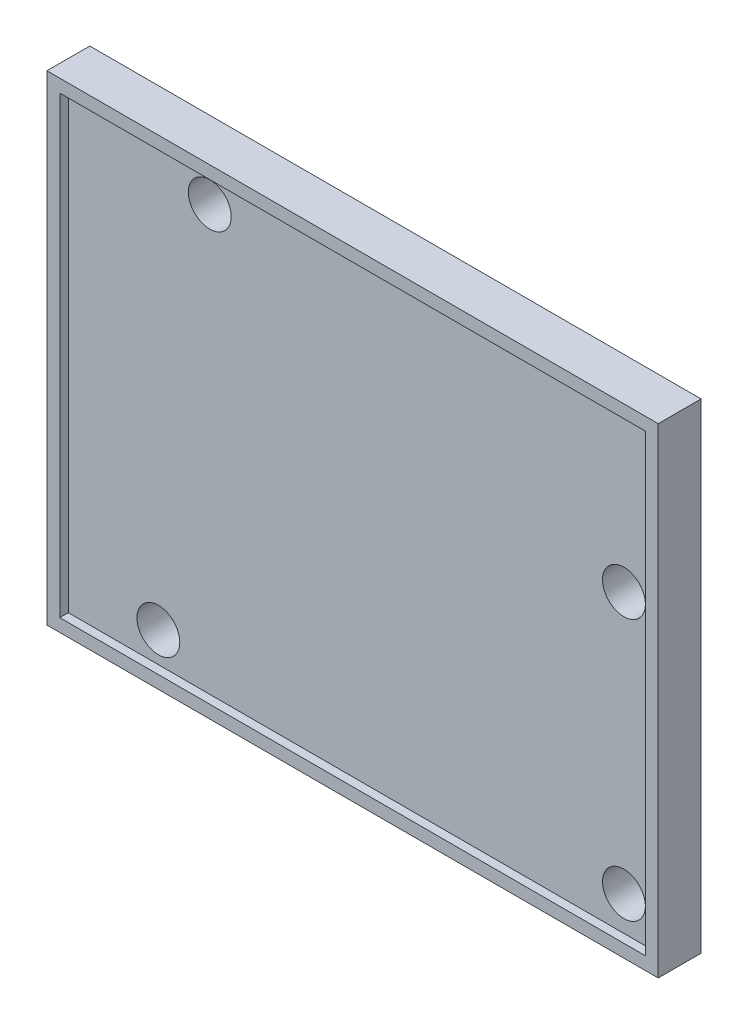
ISO-10303-21;
HEADER;
FILE_DESCRIPTION(('STEP AP214'),'2;1');
FILE_NAME('part.step','',(''),(''),'','','');
FILE_SCHEMA(('AUTOMOTIVE_DESIGN { 1 0 10303 214 1 1 1 1 }'));
ENDSEC;
DATA;
#1=APPLICATION_CONTEXT('core data for automotive mechanical design processes');
#2=APPLICATION_PROTOCOL_DEFINITION('international standard','automotive_design',2000,#1);
#3=PRODUCT_CONTEXT('',#1,'mechanical');
#4=PRODUCT('Part','Part','',(#3));
#5=PRODUCT_RELATED_PRODUCT_CATEGORY('part','',(#4));
#6=PRODUCT_DEFINITION_FORMATION('','',#4);
#7=PRODUCT_DEFINITION_CONTEXT('part definition',#1,'design');
#8=PRODUCT_DEFINITION('design','',#6,#7);
#9=PRODUCT_DEFINITION_SHAPE('','',#8);
#10=(LENGTH_UNIT() NAMED_UNIT(*) SI_UNIT(.MILLI.,.METRE.));
#11=(NAMED_UNIT(*) PLANE_ANGLE_UNIT() SI_UNIT($,.RADIAN.));
#12=(NAMED_UNIT(*) SI_UNIT($,.STERADIAN.) SOLID_ANGLE_UNIT());
#13=UNCERTAINTY_MEASURE_WITH_UNIT(LENGTH_MEASURE(1.E-05),#10,'distance_accuracy_value','');
#14=(GEOMETRIC_REPRESENTATION_CONTEXT(3) GLOBAL_UNCERTAINTY_ASSIGNED_CONTEXT((#13)) GLOBAL_UNIT_ASSIGNED_CONTEXT((#10,
#11,#12)) REPRESENTATION_CONTEXT('',''));
#15=CARTESIAN_POINT('',(0.,0.,0.));
#16=DIRECTION('',(0.,0.,1.));
#17=DIRECTION('',(1.,0.,0.));
#18=AXIS2_PLACEMENT_3D('',#15,#16,#17);
#19=CARTESIAN_POINT('',(30.655,-22.5,0.));
#20=DIRECTION('',(0.,0.,1.));
#21=DIRECTION('',(1.,0.,0.));
#22=AXIS2_PLACEMENT_3D('',#19,#20,#21);
#23=CYLINDRICAL_SURFACE('',#22,2.5);
#24=CARTESIAN_POINT('',(30.655,-22.5,0.));
#25=DIRECTION('',(0.,0.,1.));
#26=DIRECTION('',(1.,0.,0.));
#27=AXIS2_PLACEMENT_3D('',#24,#25,#26);
#28=CIRCLE('',#27,2.5);
#29=CARTESIAN_POINT('',(33.155,-22.5,0.));
#30=VERTEX_POINT('',#29);
#31=EDGE_CURVE('E163',#30,#30,#28,.T.);
#32=ORIENTED_EDGE('',*,*,#31,.F.);
#33=EDGE_LOOP('',(#32));
#34=FACE_BOUND('',#33,.T.);
#35=CARTESIAN_POINT('',(30.655,-22.5,4.));
#36=DIRECTION('',(0.,0.,1.));
#37=DIRECTION('',(1.,0.,0.));
#38=AXIS2_PLACEMENT_3D('',#35,#36,#37);
#39=CIRCLE('',#38,2.5);
#40=CARTESIAN_POINT('',(33.155,-22.5,4.));
#41=VERTEX_POINT('',#40);
#42=EDGE_CURVE('E160',#41,#41,#39,.F.);
#43=ORIENTED_EDGE('',*,*,#42,.F.);
#44=EDGE_LOOP('',(#43));
#45=FACE_BOUND('',#44,.T.);
#46=ADVANCED_FACE('F41',(#34,#45),#23,.F.);
#47=CARTESIAN_POINT('',(-17.655,23.,0.));
#48=DIRECTION('',(0.,0.,1.));
#49=DIRECTION('',(1.,0.,0.));
#50=AXIS2_PLACEMENT_3D('',#47,#48,#49);
#51=CYLINDRICAL_SURFACE('',#50,2.5);
#52=CARTESIAN_POINT('',(-17.655,23.,0.));
#53=DIRECTION('',(0.,0.,1.));
#54=DIRECTION('',(1.,0.,0.));
#55=AXIS2_PLACEMENT_3D('',#52,#53,#54);
#56=CIRCLE('',#55,2.5);
#57=CARTESIAN_POINT('',(-15.155,23.,0.));
#58=VERTEX_POINT('',#57);
#59=EDGE_CURVE('E171',#58,#58,#56,.T.);
#60=ORIENTED_EDGE('',*,*,#59,.F.);
#61=EDGE_LOOP('',(#60));
#62=FACE_BOUND('',#61,.T.);
#63=CARTESIAN_POINT('',(-17.655,23.,4.));
#64=DIRECTION('',(0.,0.,1.));
#65=DIRECTION('',(1.,0.,0.));
#66=AXIS2_PLACEMENT_3D('',#63,#64,#65);
#67=CIRCLE('',#66,2.5);
#68=CARTESIAN_POINT('',(-15.155,23.,4.));
#69=VERTEX_POINT('',#68);
#70=EDGE_CURVE('E157',#69,#69,#67,.F.);
#71=ORIENTED_EDGE('',*,*,#70,.F.);
#72=EDGE_LOOP('',(#71));
#73=FACE_BOUND('',#72,.T.);
#74=ADVANCED_FACE('F219',(#62,#73),#51,.F.);
#75=CARTESIAN_POINT('',(30.655,8.,0.));
#76=DIRECTION('',(0.,0.,1.));
#77=DIRECTION('',(1.,0.,0.));
#78=AXIS2_PLACEMENT_3D('',#75,#76,#77);
#79=CYLINDRICAL_SURFACE('',#78,2.5);
#80=CARTESIAN_POINT('',(30.655,8.,0.));
#81=DIRECTION('',(0.,0.,1.));
#82=DIRECTION('',(1.,0.,0.));
#83=AXIS2_PLACEMENT_3D('',#80,#81,#82);
#84=CIRCLE('',#83,2.5);
#85=CARTESIAN_POINT('',(33.155,8.,0.));
#86=VERTEX_POINT('',#85);
#87=EDGE_CURVE('E168',#86,#86,#84,.T.);
#88=ORIENTED_EDGE('',*,*,#87,.F.);
#89=EDGE_LOOP('',(#88));
#90=FACE_BOUND('',#89,.T.);
#91=CARTESIAN_POINT('',(30.655,8.,4.));
#92=DIRECTION('',(0.,0.,1.));
#93=DIRECTION('',(1.,0.,0.));
#94=AXIS2_PLACEMENT_3D('',#91,#92,#93);
#95=CIRCLE('',#94,2.5);
#96=CARTESIAN_POINT('',(33.155,8.,4.));
#97=VERTEX_POINT('',#96);
#98=EDGE_CURVE('E154',#97,#97,#95,.F.);
#99=ORIENTED_EDGE('',*,*,#98,.F.);
#100=EDGE_LOOP('',(#99));
#101=FACE_BOUND('',#100,.T.);
#102=ADVANCED_FACE('F215',(#90,#101),#79,.F.);
#103=CARTESIAN_POINT('',(-23.655,-23.,0.));
#104=DIRECTION('',(0.,0.,1.));
#105=DIRECTION('',(1.,0.,0.));
#106=AXIS2_PLACEMENT_3D('',#103,#104,#105);
#107=CYLINDRICAL_SURFACE('',#106,2.5);
#108=CARTESIAN_POINT('',(-23.655,-23.,0.));
#109=DIRECTION('',(0.,0.,1.));
#110=DIRECTION('',(1.,0.,0.));
#111=AXIS2_PLACEMENT_3D('',#108,#109,#110);
#112=CIRCLE('',#111,2.5);
#113=CARTESIAN_POINT('',(-21.155,-23.,0.));
#114=VERTEX_POINT('',#113);
#115=EDGE_CURVE('E164',#114,#114,#112,.T.);
#116=ORIENTED_EDGE('',*,*,#115,.F.);
#117=EDGE_LOOP('',(#116));
#118=FACE_BOUND('',#117,.T.);
#119=CARTESIAN_POINT('',(-23.655,-23.,4.));
#120=DIRECTION('',(0.,0.,1.));
#121=DIRECTION('',(1.,0.,0.));
#122=AXIS2_PLACEMENT_3D('',#119,#120,#121);
#123=CIRCLE('',#122,2.5);
#124=CARTESIAN_POINT('',(-21.155,-23.,4.));
#125=VERTEX_POINT('',#124);
#126=EDGE_CURVE('E45',#125,#125,#123,.F.);
#127=ORIENTED_EDGE('',*,*,#126,.F.);
#128=EDGE_LOOP('',(#127));
#129=FACE_BOUND('',#128,.T.);
#130=ADVANCED_FACE('F210',(#118,#129),#107,.F.);
#131=CARTESIAN_POINT('',(35.655,28.,5.));
#132=DIRECTION('',(0.,-1.,0.));
#133=DIRECTION('',(1.,0.,0.));
#134=AXIS2_PLACEMENT_3D('',#131,#132,#133);
#135=PLANE('',#134);
#136=DIRECTION('',(-1.,0.,0.));
#137=VECTOR('',#136,1.);
#138=CARTESIAN_POINT('',(35.655,28.,0.));
#139=LINE('',#138,#137);
#140=CARTESIAN_POINT('',(35.655,28.,0.));
#141=VERTEX_POINT('',#140);
#142=CARTESIAN_POINT('',(-35.655,28.,0.));
#143=VERTEX_POINT('',#142);
#144=EDGE_CURVE('E167',#141,#143,#139,.T.);
#145=ORIENTED_EDGE('',*,*,#144,.T.);
#146=DIRECTION('',(0.,0.,-1.));
#147=VECTOR('',#146,1.);
#148=CARTESIAN_POINT('',(-35.655,28.,5.));
#149=LINE('',#148,#147);
#150=CARTESIAN_POINT('',(-35.655,28.,5.));
#151=VERTEX_POINT('',#150);
#152=EDGE_CURVE('E11',#151,#143,#149,.T.);
#153=ORIENTED_EDGE('',*,*,#152,.F.);
#154=DIRECTION('',(-1.,0.,0.));
#155=VECTOR('',#154,1.);
#156=CARTESIAN_POINT('',(35.655,28.,5.));
#157=LINE('',#156,#155);
#158=CARTESIAN_POINT('',(35.655,28.,5.));
#159=VERTEX_POINT('',#158);
#160=EDGE_CURVE('E176',#159,#151,#157,.T.);
#161=ORIENTED_EDGE('',*,*,#160,.F.);
#162=DIRECTION('',(0.,0.,-1.));
#163=VECTOR('',#162,1.);
#164=CARTESIAN_POINT('',(35.655,28.,5.));
#165=LINE('',#164,#163);
#166=EDGE_CURVE('E66',#159,#141,#165,.T.);
#167=ORIENTED_EDGE('',*,*,#166,.T.);
#168=EDGE_LOOP('',(#145,#153,#161,#167));
#169=FACE_BOUND('',#168,.T.);
#170=ADVANCED_FACE('F43',(#169),#135,.F.);
#171=CARTESIAN_POINT('',(-35.655,28.,5.));
#172=DIRECTION('',(1.,0.,0.));
#173=DIRECTION('',(0.,1.,0.));
#174=AXIS2_PLACEMENT_3D('',#171,#172,#173);
#175=PLANE('',#174);
#176=DIRECTION('',(0.,-1.,0.));
#177=VECTOR('',#176,1.);
#178=CARTESIAN_POINT('',(-35.655,28.,0.));
#179=LINE('',#178,#177);
#180=CARTESIAN_POINT('',(-35.655,-28.,0.));
#181=VERTEX_POINT('',#180);
#182=EDGE_CURVE('E186',#143,#181,#179,.T.);
#183=ORIENTED_EDGE('',*,*,#182,.T.);
#184=DIRECTION('',(0.,0.,-1.));
#185=VECTOR('',#184,1.);
#186=CARTESIAN_POINT('',(-35.655,-28.,5.));
#187=LINE('',#186,#185);
#188=CARTESIAN_POINT('',(-35.655,-28.,5.));
#189=VERTEX_POINT('',#188);
#190=EDGE_CURVE('E50',#189,#181,#187,.T.);
#191=ORIENTED_EDGE('',*,*,#190,.F.);
#192=DIRECTION('',(0.,-1.,0.));
#193=VECTOR('',#192,1.);
#194=CARTESIAN_POINT('',(-35.655,28.,5.));
#195=LINE('',#194,#193);
#196=EDGE_CURVE('E92',#151,#189,#195,.T.);
#197=ORIENTED_EDGE('',*,*,#196,.F.);
#198=ORIENTED_EDGE('',*,*,#152,.T.);
#199=EDGE_LOOP('',(#183,#191,#197,#198));
#200=FACE_BOUND('',#199,.T.);
#201=ADVANCED_FACE('F201',(#200),#175,.F.);
#202=CARTESIAN_POINT('',(35.655,-28.,5.));
#203=DIRECTION('',(0.,-1.,0.));
#204=DIRECTION('',(1.,0.,0.));
#205=AXIS2_PLACEMENT_3D('',#202,#203,#204);
#206=PLANE('',#205);
#207=DIRECTION('',(-1.,0.,0.));
#208=VECTOR('',#207,1.);
#209=CARTESIAN_POINT('',(35.655,-28.,0.));
#210=LINE('',#209,#208);
#211=CARTESIAN_POINT('',(35.655,-28.,0.));
#212=VERTEX_POINT('',#211);
#213=EDGE_CURVE('E189',#212,#181,#210,.T.);
#214=ORIENTED_EDGE('',*,*,#213,.F.);
#215=DIRECTION('',(0.,0.,-1.));
#216=VECTOR('',#215,1.);
#217=CARTESIAN_POINT('',(35.655,-28.,5.));
#218=LINE('',#217,#216);
#219=CARTESIAN_POINT('',(35.655,-28.,5.));
#220=VERTEX_POINT('',#219);
#221=EDGE_CURVE('E195',#220,#212,#218,.T.);
#222=ORIENTED_EDGE('',*,*,#221,.F.);
#223=DIRECTION('',(-1.,0.,0.));
#224=VECTOR('',#223,1.);
#225=CARTESIAN_POINT('',(35.655,-28.,5.));
#226=LINE('',#225,#224);
#227=EDGE_CURVE('E180',#220,#189,#226,.T.);
#228=ORIENTED_EDGE('',*,*,#227,.T.);
#229=ORIENTED_EDGE('',*,*,#190,.T.);
#230=EDGE_LOOP('',(#214,#222,#228,#229));
#231=FACE_BOUND('',#230,.T.);
#232=ADVANCED_FACE('F199',(#231),#206,.T.);
#233=CARTESIAN_POINT('',(35.655,28.,5.));
#234=DIRECTION('',(1.,0.,0.));
#235=DIRECTION('',(0.,0.,-1.));
#236=AXIS2_PLACEMENT_3D('',#233,#234,#235);
#237=PLANE('',#236);
#238=DIRECTION('',(0.,-1.,0.));
#239=VECTOR('',#238,1.);
#240=CARTESIAN_POINT('',(35.655,28.,0.));
#241=LINE('',#240,#239);
#242=EDGE_CURVE('E178',#141,#212,#241,.T.);
#243=ORIENTED_EDGE('',*,*,#242,.F.);
#244=ORIENTED_EDGE('',*,*,#166,.F.);
#245=DIRECTION('',(0.,-1.,0.));
#246=VECTOR('',#245,1.);
#247=CARTESIAN_POINT('',(35.655,28.,5.));
#248=LINE('',#247,#246);
#249=EDGE_CURVE('E183',#159,#220,#248,.T.);
#250=ORIENTED_EDGE('',*,*,#249,.T.);
#251=ORIENTED_EDGE('',*,*,#221,.T.);
#252=EDGE_LOOP('',(#243,#244,#250,#251));
#253=FACE_BOUND('',#252,.T.);
#254=ADVANCED_FACE('F205',(#253),#237,.T.);
#255=CARTESIAN_POINT('',(0.,0.,5.));
#256=DIRECTION('',(0.,0.,1.));
#257=DIRECTION('',(1.,0.,0.));
#258=AXIS2_PLACEMENT_3D('',#255,#256,#257);
#259=PLANE('',#258);
#260=DIRECTION('',(0.,-1.,0.));
#261=VECTOR('',#260,1.);
#262=CARTESIAN_POINT('',(-34.155,-26.5,5.));
#263=LINE('',#262,#261);
#264=CARTESIAN_POINT('',(-34.155,26.5,5.));
#265=VERTEX_POINT('',#264);
#266=CARTESIAN_POINT('',(-34.155,-26.5,5.));
#267=VERTEX_POINT('',#266);
#268=EDGE_CURVE('E57',#265,#267,#263,.T.);
#269=ORIENTED_EDGE('',*,*,#268,.F.);
#270=DIRECTION('',(-1.,0.,0.));
#271=VECTOR('',#270,1.);
#272=CARTESIAN_POINT('',(34.155,26.5,5.));
#273=LINE('',#272,#271);
#274=CARTESIAN_POINT('',(34.155,26.5,5.));
#275=VERTEX_POINT('',#274);
#276=EDGE_CURVE('E136',#275,#265,#273,.T.);
#277=ORIENTED_EDGE('',*,*,#276,.F.);
#278=DIRECTION('',(0.,1.,0.));
#279=VECTOR('',#278,1.);
#280=CARTESIAN_POINT('',(34.155,-26.5,5.));
#281=LINE('',#280,#279);
#282=CARTESIAN_POINT('',(34.155,-26.5,5.));
#283=VERTEX_POINT('',#282);
#284=EDGE_CURVE('E139',#283,#275,#281,.T.);
#285=ORIENTED_EDGE('',*,*,#284,.F.);
#286=DIRECTION('',(1.,0.,0.));
#287=VECTOR('',#286,1.);
#288=CARTESIAN_POINT('',(34.155,-26.5,5.));
#289=LINE('',#288,#287);
#290=EDGE_CURVE('E145',#267,#283,#289,.T.);
#291=ORIENTED_EDGE('',*,*,#290,.F.);
#292=EDGE_LOOP('',(#269,#277,#285,#291));
#293=FACE_BOUND('',#292,.T.);
#294=ORIENTED_EDGE('',*,*,#160,.T.);
#295=ORIENTED_EDGE('',*,*,#196,.T.);
#296=ORIENTED_EDGE('',*,*,#227,.F.);
#297=ORIENTED_EDGE('',*,*,#249,.F.);
#298=EDGE_LOOP('',(#294,#295,#296,#297));
#299=FACE_BOUND('',#298,.T.);
#300=ADVANCED_FACE('F208',(#293,#299),#259,.T.);
#301=CARTESIAN_POINT('',(0.,0.,0.));
#302=DIRECTION('',(0.,0.,1.));
#303=DIRECTION('',(1.,0.,0.));
#304=AXIS2_PLACEMENT_3D('',#301,#302,#303);
#305=PLANE('',#304);
#306=ORIENTED_EDGE('',*,*,#115,.T.);
#307=EDGE_LOOP('',(#306));
#308=FACE_BOUND('',#307,.T.);
#309=ORIENTED_EDGE('',*,*,#87,.T.);
#310=EDGE_LOOP('',(#309));
#311=FACE_BOUND('',#310,.T.);
#312=ORIENTED_EDGE('',*,*,#59,.T.);
#313=EDGE_LOOP('',(#312));
#314=FACE_BOUND('',#313,.T.);
#315=ORIENTED_EDGE('',*,*,#31,.T.);
#316=EDGE_LOOP('',(#315));
#317=FACE_BOUND('',#316,.T.);
#318=ORIENTED_EDGE('',*,*,#144,.F.);
#319=ORIENTED_EDGE('',*,*,#242,.T.);
#320=ORIENTED_EDGE('',*,*,#213,.T.);
#321=ORIENTED_EDGE('',*,*,#182,.F.);
#322=EDGE_LOOP('',(#318,#319,#320,#321));
#323=FACE_BOUND('',#322,.T.);
#324=ADVANCED_FACE('F204',(#308,#311,#314,#317,#323),#305,.F.);
#325=CARTESIAN_POINT('',(0.,0.,4.));
#326=DIRECTION('',(0.,0.,1.));
#327=DIRECTION('',(1.,0.,0.));
#328=AXIS2_PLACEMENT_3D('',#325,#326,#327);
#329=PLANE('',#328);
#330=DIRECTION('',(0.,-1.,0.));
#331=VECTOR('',#330,1.);
#332=CARTESIAN_POINT('',(-34.155,-26.5,4.));
#333=LINE('',#332,#331);
#334=CARTESIAN_POINT('',(-34.155,26.5,4.));
#335=VERTEX_POINT('',#334);
#336=CARTESIAN_POINT('',(-34.155,-26.5,4.));
#337=VERTEX_POINT('',#336);
#338=EDGE_CURVE('E117',#335,#337,#333,.T.);
#339=ORIENTED_EDGE('',*,*,#338,.T.);
#340=DIRECTION('',(1.,0.,0.));
#341=VECTOR('',#340,1.);
#342=CARTESIAN_POINT('',(34.155,-26.5,4.));
#343=LINE('',#342,#341);
#344=CARTESIAN_POINT('',(34.155,-26.5,4.));
#345=VERTEX_POINT('',#344);
#346=EDGE_CURVE('E126',#337,#345,#343,.T.);
#347=ORIENTED_EDGE('',*,*,#346,.T.);
#348=DIRECTION('',(0.,1.,0.));
#349=VECTOR('',#348,1.);
#350=CARTESIAN_POINT('',(34.155,-26.5,4.));
#351=LINE('',#350,#349);
#352=CARTESIAN_POINT('',(34.155,26.5,4.));
#353=VERTEX_POINT('',#352);
#354=EDGE_CURVE('E131',#345,#353,#351,.T.);
#355=ORIENTED_EDGE('',*,*,#354,.T.);
#356=DIRECTION('',(-1.,0.,0.));
#357=VECTOR('',#356,1.);
#358=CARTESIAN_POINT('',(34.155,26.5,4.));
#359=LINE('',#358,#357);
#360=EDGE_CURVE('E123',#353,#335,#359,.T.);
#361=ORIENTED_EDGE('',*,*,#360,.T.);
#362=EDGE_LOOP('',(#339,#347,#355,#361));
#363=FACE_BOUND('',#362,.T.);
#364=ORIENTED_EDGE('',*,*,#126,.T.);
#365=EDGE_LOOP('',(#364));
#366=FACE_BOUND('',#365,.T.);
#367=ORIENTED_EDGE('',*,*,#98,.T.);
#368=EDGE_LOOP('',(#367));
#369=FACE_BOUND('',#368,.T.);
#370=ORIENTED_EDGE('',*,*,#70,.T.);
#371=EDGE_LOOP('',(#370));
#372=FACE_BOUND('',#371,.T.);
#373=ORIENTED_EDGE('',*,*,#42,.T.);
#374=EDGE_LOOP('',(#373));
#375=FACE_BOUND('',#374,.T.);
#376=ADVANCED_FACE('F133',(#363,#366,#369,#372,#375),#329,.T.);
#377=CARTESIAN_POINT('',(-34.155,-26.5,4.));
#378=DIRECTION('',(-1.,0.,0.));
#379=DIRECTION('',(0.,0.,1.));
#380=AXIS2_PLACEMENT_3D('',#377,#378,#379);
#381=PLANE('',#380);
#382=ORIENTED_EDGE('',*,*,#268,.T.);
#383=DIRECTION('',(0.,0.,1.));
#384=VECTOR('',#383,1.);
#385=CARTESIAN_POINT('',(-34.155,-26.5,4.));
#386=LINE('',#385,#384);
#387=EDGE_CURVE('E113',#337,#267,#386,.T.);
#388=ORIENTED_EDGE('',*,*,#387,.F.);
#389=ORIENTED_EDGE('',*,*,#338,.F.);
#390=DIRECTION('',(0.,0.,1.));
#391=VECTOR('',#390,1.);
#392=CARTESIAN_POINT('',(-34.155,26.5,4.));
#393=LINE('',#392,#391);
#394=EDGE_CURVE('E149',#335,#265,#393,.T.);
#395=ORIENTED_EDGE('',*,*,#394,.T.);
#396=EDGE_LOOP('',(#382,#388,#389,#395));
#397=FACE_BOUND('',#396,.T.);
#398=ADVANCED_FACE('F115',(#397),#381,.F.);
#399=CARTESIAN_POINT('',(34.155,26.5,4.));
#400=DIRECTION('',(0.,1.,0.));
#401=DIRECTION('',(-1.,0.,0.));
#402=AXIS2_PLACEMENT_3D('',#399,#400,#401);
#403=PLANE('',#402);
#404=ORIENTED_EDGE('',*,*,#276,.T.);
#405=ORIENTED_EDGE('',*,*,#394,.F.);
#406=ORIENTED_EDGE('',*,*,#360,.F.);
#407=DIRECTION('',(0.,0.,1.));
#408=VECTOR('',#407,1.);
#409=CARTESIAN_POINT('',(34.155,26.5,4.));
#410=LINE('',#409,#408);
#411=EDGE_CURVE('E151',#353,#275,#410,.T.);
#412=ORIENTED_EDGE('',*,*,#411,.T.);
#413=EDGE_LOOP('',(#404,#405,#406,#412));
#414=FACE_BOUND('',#413,.T.);
#415=ADVANCED_FACE('F297',(#414),#403,.F.);
#416=CARTESIAN_POINT('',(34.155,-26.5,4.));
#417=DIRECTION('',(1.,0.,0.));
#418=DIRECTION('',(0.,0.,-1.));
#419=AXIS2_PLACEMENT_3D('',#416,#417,#418);
#420=PLANE('',#419);
#421=ORIENTED_EDGE('',*,*,#284,.T.);
#422=ORIENTED_EDGE('',*,*,#411,.F.);
#423=ORIENTED_EDGE('',*,*,#354,.F.);
#424=DIRECTION('',(0.,0.,1.));
#425=VECTOR('',#424,1.);
#426=CARTESIAN_POINT('',(34.155,-26.5,4.));
#427=LINE('',#426,#425);
#428=EDGE_CURVE('E122',#345,#283,#427,.T.);
#429=ORIENTED_EDGE('',*,*,#428,.T.);
#430=EDGE_LOOP('',(#421,#422,#423,#429));
#431=FACE_BOUND('',#430,.T.);
#432=ADVANCED_FACE('F306',(#431),#420,.F.);
#433=CARTESIAN_POINT('',(34.155,-26.5,4.));
#434=DIRECTION('',(0.,-1.,0.));
#435=DIRECTION('',(1.,0.,0.));
#436=AXIS2_PLACEMENT_3D('',#433,#434,#435);
#437=PLANE('',#436);
#438=ORIENTED_EDGE('',*,*,#290,.T.);
#439=ORIENTED_EDGE('',*,*,#428,.F.);
#440=ORIENTED_EDGE('',*,*,#346,.F.);
#441=ORIENTED_EDGE('',*,*,#387,.T.);
#442=EDGE_LOOP('',(#438,#439,#440,#441));
#443=FACE_BOUND('',#442,.T.);
#444=ADVANCED_FACE('F127',(#443),#437,.F.);
#445=CLOSED_SHELL('',(#46,#74,#102,#130,#170,#201,#232,#254,#300,#324,#376,#398,#415,#432,#444));
#446=MANIFOLD_SOLID_BREP('B2',#445);
#447=ADVANCED_BREP_SHAPE_REPRESENTATION('',(#18,#446),#14);
#448=SHAPE_DEFINITION_REPRESENTATION(#9,#447);
ENDSEC;
END-ISO-10303-21;
